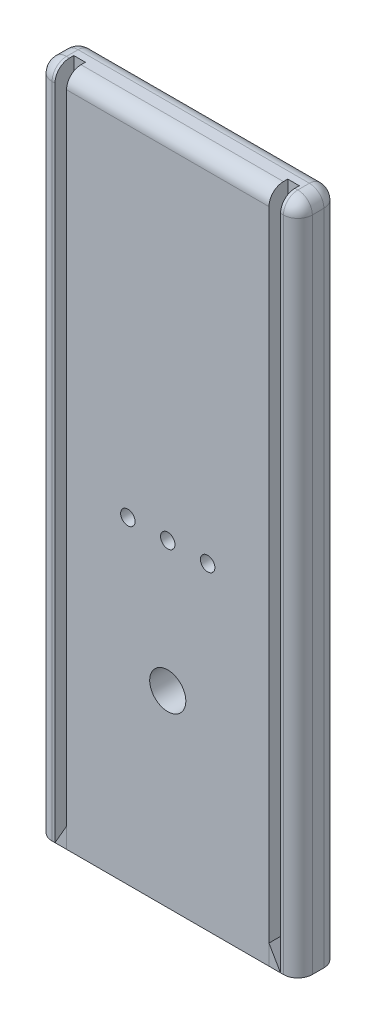
ISO-10303-21;
HEADER;
FILE_DESCRIPTION(('STEP AP214'),'2;1');
FILE_NAME('part.step','',(''),(''),'','','');
FILE_SCHEMA(('AUTOMOTIVE_DESIGN { 1 0 10303 214 1 1 1 1 }'));
ENDSEC;
DATA;
#1=APPLICATION_CONTEXT('core data for automotive mechanical design processes');
#2=APPLICATION_PROTOCOL_DEFINITION('international standard','automotive_design',2000,#1);
#3=PRODUCT_CONTEXT('',#1,'mechanical');
#4=PRODUCT('Part','Part','',(#3));
#5=PRODUCT_RELATED_PRODUCT_CATEGORY('part','',(#4));
#6=PRODUCT_DEFINITION_FORMATION('','',#4);
#7=PRODUCT_DEFINITION_CONTEXT('part definition',#1,'design');
#8=PRODUCT_DEFINITION('design','',#6,#7);
#9=PRODUCT_DEFINITION_SHAPE('','',#8);
#10=(LENGTH_UNIT() NAMED_UNIT(*) SI_UNIT(.MILLI.,.METRE.));
#11=(NAMED_UNIT(*) PLANE_ANGLE_UNIT() SI_UNIT($,.RADIAN.));
#12=(NAMED_UNIT(*) SI_UNIT($,.STERADIAN.) SOLID_ANGLE_UNIT());
#13=UNCERTAINTY_MEASURE_WITH_UNIT(LENGTH_MEASURE(1.E-05),#10,'distance_accuracy_value','');
#14=(GEOMETRIC_REPRESENTATION_CONTEXT(3) GLOBAL_UNCERTAINTY_ASSIGNED_CONTEXT((#13)) GLOBAL_UNIT_ASSIGNED_CONTEXT((#10,
#11,#12)) REPRESENTATION_CONTEXT('',''));
#15=CARTESIAN_POINT('',(0.,0.,0.));
#16=DIRECTION('',(0.,0.,1.));
#17=DIRECTION('',(1.,0.,0.));
#18=AXIS2_PLACEMENT_3D('',#15,#16,#17);
#19=CARTESIAN_POINT('',(44.45,-147.6375,8.89));
#20=DIRECTION('',(0.,1.,0.));
#21=DIRECTION('',(0.,0.,1.));
#22=AXIS2_PLACEMENT_3D('',#19,#20,#21);
#23=PLANE('',#22);
#24=DIRECTION('',(1.,0.,0.));
#25=VECTOR('',#24,1.);
#26=CARTESIAN_POINT('',(44.45,-147.6375,0.635));
#27=LINE('',#26,#25);
#28=CARTESIAN_POINT('',(44.45,-147.6375,0.635));
#29=VERTEX_POINT('',#28);
#30=CARTESIAN_POINT('',(49.53,-147.6375,0.635));
#31=VERTEX_POINT('',#30);
#32=EDGE_CURVE('E91',#29,#31,#27,.T.);
#33=ORIENTED_EDGE('',*,*,#32,.T.);
#34=DIRECTION('',(0.,0.,-1.));
#35=VECTOR('',#34,1.);
#36=CARTESIAN_POINT('',(49.53,-147.6375,8.89));
#37=LINE('',#36,#35);
#38=CARTESIAN_POINT('',(49.53,-147.6375,8.89));
#39=VERTEX_POINT('',#38);
#40=EDGE_CURVE('E12',#39,#31,#37,.T.);
#41=ORIENTED_EDGE('',*,*,#40,.F.);
#42=DIRECTION('',(1.,0.,0.));
#43=VECTOR('',#42,1.);
#44=CARTESIAN_POINT('',(44.45,-147.6375,8.89));
#45=LINE('',#44,#43);
#46=CARTESIAN_POINT('',(44.45,-147.6375,8.89));
#47=VERTEX_POINT('',#46);
#48=EDGE_CURVE('E84',#47,#39,#45,.T.);
#49=ORIENTED_EDGE('',*,*,#48,.F.);
#50=DIRECTION('',(0.,0.,-1.));
#51=VECTOR('',#50,1.);
#52=CARTESIAN_POINT('',(44.45,-147.6375,8.89));
#53=LINE('',#52,#51);
#54=EDGE_CURVE('E92',#47,#29,#53,.T.);
#55=ORIENTED_EDGE('',*,*,#54,.T.);
#56=EDGE_LOOP('',(#33,#41,#49,#55));
#57=FACE_BOUND('',#56,.T.);
#58=ADVANCED_FACE('F44',(#57),#23,.F.);
#59=CARTESIAN_POINT('',(49.53,-147.6375,8.89));
#60=DIRECTION('',(-0.865972767044653,-0.500091158427169,0.));
#61=DIRECTION('',(0.500091158427169,-0.865972767044653,0.));
#62=AXIS2_PLACEMENT_3D('',#59,#60,#61);
#63=PLANE('',#62);
#64=DIRECTION('',(-0.500091158427169,0.865972767044653,0.));
#65=VECTOR('',#64,1.);
#66=CARTESIAN_POINT('',(49.53,-147.6375,0.635));
#67=LINE('',#66,#65);
#68=CARTESIAN_POINT('',(44.45,-138.840820469767,0.635));
#69=VERTEX_POINT('',#68);
#70=EDGE_CURVE('E72',#31,#69,#67,.T.);
#71=ORIENTED_EDGE('',*,*,#70,.T.);
#72=DIRECTION('',(0.,0.,-1.));
#73=VECTOR('',#72,1.);
#74=CARTESIAN_POINT('',(44.45,-138.840820469767,8.89));
#75=LINE('',#74,#73);
#76=CARTESIAN_POINT('',(44.45,-138.840820469767,8.89));
#77=VERTEX_POINT('',#76);
#78=EDGE_CURVE('E52',#77,#69,#75,.T.);
#79=ORIENTED_EDGE('',*,*,#78,.F.);
#80=DIRECTION('',(-0.500091158427169,0.865972767044653,0.));
#81=VECTOR('',#80,1.);
#82=CARTESIAN_POINT('',(49.53,-147.6375,8.89));
#83=LINE('',#82,#81);
#84=EDGE_CURVE('E80',#39,#77,#83,.T.);
#85=ORIENTED_EDGE('',*,*,#84,.F.);
#86=ORIENTED_EDGE('',*,*,#40,.T.);
#87=EDGE_LOOP('',(#71,#79,#85,#86));
#88=FACE_BOUND('',#87,.T.);
#89=ADVANCED_FACE('F81',(#88),#63,.F.);
#90=CARTESIAN_POINT('',(44.45,-138.840820469767,8.89));
#91=DIRECTION('',(1.,0.,0.));
#92=DIRECTION('',(0.,0.,-1.));
#93=AXIS2_PLACEMENT_3D('',#90,#91,#92);
#94=PLANE('',#93);
#95=DIRECTION('',(0.,-1.,0.));
#96=VECTOR('',#95,1.);
#97=CARTESIAN_POINT('',(44.45,-138.840820469767,0.635));
#98=LINE('',#97,#96);
#99=EDGE_CURVE('E77',#69,#29,#98,.T.);
#100=ORIENTED_EDGE('',*,*,#99,.T.);
#101=ORIENTED_EDGE('',*,*,#54,.F.);
#102=DIRECTION('',(0.,-1.,0.));
#103=VECTOR('',#102,1.);
#104=CARTESIAN_POINT('',(44.45,-138.840820469767,8.89));
#105=LINE('',#104,#103);
#106=EDGE_CURVE('E60',#77,#47,#105,.T.);
#107=ORIENTED_EDGE('',*,*,#106,.F.);
#108=ORIENTED_EDGE('',*,*,#78,.T.);
#109=EDGE_LOOP('',(#100,#101,#107,#108));
#110=FACE_BOUND('',#109,.T.);
#111=ADVANCED_FACE('F99',(#110),#94,.F.);
#112=CARTESIAN_POINT('',(0.,0.,8.89));
#113=DIRECTION('',(0.,0.,-1.));
#114=DIRECTION('',(-1.,0.,0.));
#115=AXIS2_PLACEMENT_3D('',#112,#113,#114);
#116=PLANE('',#115);
#117=ORIENTED_EDGE('',*,*,#48,.T.);
#118=ORIENTED_EDGE('',*,*,#84,.T.);
#119=ORIENTED_EDGE('',*,*,#106,.T.);
#120=EDGE_LOOP('',(#117,#118,#119));
#121=FACE_BOUND('',#120,.T.);
#122=ADVANCED_FACE('F87',(#121),#116,.F.);
#123=CARTESIAN_POINT('',(0.,0.,0.635));
#124=DIRECTION('',(0.,0.,-1.));
#125=DIRECTION('',(-1.,0.,0.));
#126=AXIS2_PLACEMENT_3D('',#123,#124,#125);
#127=PLANE('',#126);
#128=ORIENTED_EDGE('',*,*,#32,.F.);
#129=ORIENTED_EDGE('',*,*,#99,.F.);
#130=ORIENTED_EDGE('',*,*,#70,.F.);
#131=EDGE_LOOP('',(#128,#129,#130));
#132=FACE_BOUND('',#131,.T.);
#133=ADVANCED_FACE('F100',(#132),#127,.T.);
#134=CLOSED_SHELL('',(#58,#89,#111,#122,#133));
#135=MANIFOLD_SOLID_BREP('B2',#134);
#136=CARTESIAN_POINT('',(-44.45,-147.6375,8.89));
#137=DIRECTION('',(0.,1.,0.));
#138=DIRECTION('',(0.,0.,1.));
#139=AXIS2_PLACEMENT_3D('',#136,#137,#138);
#140=PLANE('',#139);
#141=DIRECTION('',(1.,0.,0.));
#142=VECTOR('',#141,1.);
#143=CARTESIAN_POINT('',(-44.45,-147.6375,0.635));
#144=LINE('',#143,#142);
#145=CARTESIAN_POINT('',(-49.53,-147.6375,0.635));
#146=VERTEX_POINT('',#145);
#147=CARTESIAN_POINT('',(-44.45,-147.6375,0.635));
#148=VERTEX_POINT('',#147);
#149=EDGE_CURVE('E198',#146,#148,#144,.T.);
#150=ORIENTED_EDGE('',*,*,#149,.T.);
#151=DIRECTION('',(0.,0.,-1.));
#152=VECTOR('',#151,1.);
#153=CARTESIAN_POINT('',(-44.45,-147.6375,8.89));
#154=LINE('',#153,#152);
#155=CARTESIAN_POINT('',(-44.45,-147.6375,8.89));
#156=VERTEX_POINT('',#155);
#157=EDGE_CURVE('E42',#156,#148,#154,.T.);
#158=ORIENTED_EDGE('',*,*,#157,.F.);
#159=DIRECTION('',(1.,0.,0.));
#160=VECTOR('',#159,1.);
#161=CARTESIAN_POINT('',(-44.45,-147.6375,8.89));
#162=LINE('',#161,#160);
#163=CARTESIAN_POINT('',(-49.53,-147.6375,8.89));
#164=VERTEX_POINT('',#163);
#165=EDGE_CURVE('E191',#164,#156,#162,.T.);
#166=ORIENTED_EDGE('',*,*,#165,.F.);
#167=DIRECTION('',(0.,0.,-1.));
#168=VECTOR('',#167,1.);
#169=CARTESIAN_POINT('',(-49.53,-147.6375,8.89));
#170=LINE('',#169,#168);
#171=EDGE_CURVE('E199',#164,#146,#170,.T.);
#172=ORIENTED_EDGE('',*,*,#171,.T.);
#173=EDGE_LOOP('',(#150,#158,#166,#172));
#174=FACE_BOUND('',#173,.T.);
#175=ADVANCED_FACE('F151',(#174),#140,.F.);
#176=CARTESIAN_POINT('',(-44.45,-138.840820469767,8.89));
#177=DIRECTION('',(-1.,0.,0.));
#178=DIRECTION('',(0.,0.,1.));
#179=AXIS2_PLACEMENT_3D('',#176,#177,#178);
#180=PLANE('',#179);
#181=DIRECTION('',(0.,1.,0.));
#182=VECTOR('',#181,1.);
#183=CARTESIAN_POINT('',(-44.45,-138.840820469767,0.635));
#184=LINE('',#183,#182);
#185=CARTESIAN_POINT('',(-44.45,-138.840820469767,0.635));
#186=VERTEX_POINT('',#185);
#187=EDGE_CURVE('E179',#148,#186,#184,.T.);
#188=ORIENTED_EDGE('',*,*,#187,.T.);
#189=DIRECTION('',(0.,0.,-1.));
#190=VECTOR('',#189,1.);
#191=CARTESIAN_POINT('',(-44.45,-138.840820469767,8.89));
#192=LINE('',#191,#190);
#193=CARTESIAN_POINT('',(-44.45,-138.840820469767,8.89));
#194=VERTEX_POINT('',#193);
#195=EDGE_CURVE('E159',#194,#186,#192,.T.);
#196=ORIENTED_EDGE('',*,*,#195,.F.);
#197=DIRECTION('',(0.,1.,0.));
#198=VECTOR('',#197,1.);
#199=CARTESIAN_POINT('',(-44.45,-138.840820469767,8.89));
#200=LINE('',#199,#198);
#201=EDGE_CURVE('E187',#156,#194,#200,.T.);
#202=ORIENTED_EDGE('',*,*,#201,.F.);
#203=ORIENTED_EDGE('',*,*,#157,.T.);
#204=EDGE_LOOP('',(#188,#196,#202,#203));
#205=FACE_BOUND('',#204,.T.);
#206=ADVANCED_FACE('F188',(#205),#180,.F.);
#207=CARTESIAN_POINT('',(-49.53,-147.6375,8.89));
#208=DIRECTION('',(0.865972767044653,-0.500091158427169,0.));
#209=DIRECTION('',(0.500091158427169,0.865972767044653,0.));
#210=AXIS2_PLACEMENT_3D('',#207,#208,#209);
#211=PLANE('',#210);
#212=DIRECTION('',(-0.500091158427169,-0.865972767044653,0.));
#213=VECTOR('',#212,1.);
#214=CARTESIAN_POINT('',(-49.53,-147.6375,0.635));
#215=LINE('',#214,#213);
#216=EDGE_CURVE('E184',#186,#146,#215,.T.);
#217=ORIENTED_EDGE('',*,*,#216,.T.);
#218=ORIENTED_EDGE('',*,*,#171,.F.);
#219=DIRECTION('',(-0.500091158427169,-0.865972767044653,0.));
#220=VECTOR('',#219,1.);
#221=CARTESIAN_POINT('',(-49.53,-147.6375,8.89));
#222=LINE('',#221,#220);
#223=EDGE_CURVE('E167',#194,#164,#222,.T.);
#224=ORIENTED_EDGE('',*,*,#223,.F.);
#225=ORIENTED_EDGE('',*,*,#195,.T.);
#226=EDGE_LOOP('',(#217,#218,#224,#225));
#227=FACE_BOUND('',#226,.T.);
#228=ADVANCED_FACE('F206',(#227),#211,.F.);
#229=CARTESIAN_POINT('',(0.,0.,8.89));
#230=DIRECTION('',(0.,0.,1.));
#231=DIRECTION('',(1.,0.,0.));
#232=AXIS2_PLACEMENT_3D('',#229,#230,#231);
#233=PLANE('',#232);
#234=ORIENTED_EDGE('',*,*,#165,.T.);
#235=ORIENTED_EDGE('',*,*,#201,.T.);
#236=ORIENTED_EDGE('',*,*,#223,.T.);
#237=EDGE_LOOP('',(#234,#235,#236));
#238=FACE_BOUND('',#237,.T.);
#239=ADVANCED_FACE('F194',(#238),#233,.T.);
#240=CARTESIAN_POINT('',(0.,0.,0.635));
#241=DIRECTION('',(0.,0.,1.));
#242=DIRECTION('',(1.,0.,0.));
#243=AXIS2_PLACEMENT_3D('',#240,#241,#242);
#244=PLANE('',#243);
#245=ORIENTED_EDGE('',*,*,#149,.F.);
#246=ORIENTED_EDGE('',*,*,#216,.F.);
#247=ORIENTED_EDGE('',*,*,#187,.F.);
#248=EDGE_LOOP('',(#245,#246,#247));
#249=FACE_BOUND('',#248,.T.);
#250=ADVANCED_FACE('F207',(#249),#244,.F.);
#251=CLOSED_SHELL('',(#175,#206,#228,#239,#250));
#252=MANIFOLD_SOLID_BREP('B6',#251);
#253=CARTESIAN_POINT('',(-57.15,147.6375,8.89));
#254=DIRECTION('',(0.,-1.,0.));
#255=DIRECTION('',(0.,0.,-1.));
#256=AXIS2_PLACEMENT_3D('',#253,#254,#255);
#257=PLANE('',#256);
#258=DIRECTION('',(0.,0.,-1.));
#259=VECTOR('',#258,1.);
#260=CARTESIAN_POINT('',(-44.45,147.6375,8.89));
#261=LINE('',#260,#259);
#262=CARTESIAN_POINT('',(-44.45,147.6375,2.54));
#263=VERTEX_POINT('',#262);
#264=CARTESIAN_POINT('',(-44.45,147.6375,0.635));
#265=VERTEX_POINT('',#264);
#266=EDGE_CURVE('E444',#263,#265,#261,.T.);
#267=ORIENTED_EDGE('',*,*,#266,.F.);
#268=DIRECTION('',(-1.,0.,0.));
#269=VECTOR('',#268,1.);
#270=CARTESIAN_POINT('',(-57.15,147.6375,2.54));
#271=LINE('',#270,#269);
#272=CARTESIAN_POINT('',(44.45,147.6375,2.54));
#273=VERTEX_POINT('',#272);
#274=EDGE_CURVE('E518',#263,#273,#271,.F.);
#275=ORIENTED_EDGE('',*,*,#274,.T.);
#276=DIRECTION('',(0.,0.,-1.));
#277=VECTOR('',#276,1.);
#278=CARTESIAN_POINT('',(44.45,147.6375,8.89));
#279=LINE('',#278,#277);
#280=CARTESIAN_POINT('',(44.45,147.6375,0.635));
#281=VERTEX_POINT('',#280);
#282=EDGE_CURVE('E413',#273,#281,#279,.T.);
#283=ORIENTED_EDGE('',*,*,#282,.T.);
#284=DIRECTION('',(1.,0.,0.));
#285=VECTOR('',#284,1.);
#286=CARTESIAN_POINT('',(49.53,147.6375,0.635));
#287=LINE('',#286,#285);
#288=CARTESIAN_POINT('',(49.53,147.6375,0.635));
#289=VERTEX_POINT('',#288);
#290=EDGE_CURVE('E415',#281,#289,#287,.T.);
#291=ORIENTED_EDGE('',*,*,#290,.T.);
#292=DIRECTION('',(0.,0.,1.));
#293=VECTOR('',#292,1.);
#294=CARTESIAN_POINT('',(49.53,147.6375,8.89));
#295=LINE('',#294,#293);
#296=CARTESIAN_POINT('',(49.53,147.6375,2.54));
#297=VERTEX_POINT('',#296);
#298=EDGE_CURVE('E405',#289,#297,#295,.T.);
#299=ORIENTED_EDGE('',*,*,#298,.T.);
#300=DIRECTION('',(-1.,0.,0.));
#301=VECTOR('',#300,1.);
#302=CARTESIAN_POINT('',(-57.15,147.6375,2.54));
#303=LINE('',#302,#301);
#304=CARTESIAN_POINT('',(50.8,147.6375,2.54));
#305=VERTEX_POINT('',#304);
#306=EDGE_CURVE('E510',#297,#305,#303,.F.);
#307=ORIENTED_EDGE('',*,*,#306,.T.);
#308=DIRECTION('',(0.,0.,-1.));
#309=VECTOR('',#308,1.);
#310=CARTESIAN_POINT('',(50.8,147.6375,8.89));
#311=LINE('',#310,#309);
#312=CARTESIAN_POINT('',(50.8,147.6375,-2.54));
#313=VERTEX_POINT('',#312);
#314=EDGE_CURVE('E508',#305,#313,#311,.T.);
#315=ORIENTED_EDGE('',*,*,#314,.T.);
#316=DIRECTION('',(-1.,0.,0.));
#317=VECTOR('',#316,1.);
#318=CARTESIAN_POINT('',(-57.15,147.6375,-2.54));
#319=LINE('',#318,#317);
#320=CARTESIAN_POINT('',(-50.8,147.6375,-2.54));
#321=VERTEX_POINT('',#320);
#322=EDGE_CURVE('E512',#313,#321,#319,.T.);
#323=ORIENTED_EDGE('',*,*,#322,.T.);
#324=DIRECTION('',(0.,0.,-1.));
#325=VECTOR('',#324,1.);
#326=CARTESIAN_POINT('',(-50.8,147.6375,8.89));
#327=LINE('',#326,#325);
#328=CARTESIAN_POINT('',(-50.8,147.6375,2.54));
#329=VERTEX_POINT('',#328);
#330=EDGE_CURVE('E514',#321,#329,#327,.F.);
#331=ORIENTED_EDGE('',*,*,#330,.T.);
#332=DIRECTION('',(-1.,0.,0.));
#333=VECTOR('',#332,1.);
#334=CARTESIAN_POINT('',(-57.15,147.6375,2.54));
#335=LINE('',#334,#333);
#336=CARTESIAN_POINT('',(-49.53,147.6375,2.54));
#337=VERTEX_POINT('',#336);
#338=EDGE_CURVE('E516',#329,#337,#335,.F.);
#339=ORIENTED_EDGE('',*,*,#338,.T.);
#340=DIRECTION('',(0.,0.,1.));
#341=VECTOR('',#340,1.);
#342=CARTESIAN_POINT('',(-49.53,147.6375,8.89));
#343=LINE('',#342,#341);
#344=CARTESIAN_POINT('',(-49.53,147.6375,0.635));
#345=VERTEX_POINT('',#344);
#346=EDGE_CURVE('E426',#345,#337,#343,.T.);
#347=ORIENTED_EDGE('',*,*,#346,.F.);
#348=DIRECTION('',(-1.,0.,0.));
#349=VECTOR('',#348,1.);
#350=CARTESIAN_POINT('',(-49.53,147.6375,0.635));
#351=LINE('',#350,#349);
#352=EDGE_CURVE('E435',#265,#345,#351,.T.);
#353=ORIENTED_EDGE('',*,*,#352,.F.);
#354=EDGE_LOOP('',(#267,#275,#283,#291,#299,#307,#315,#323,#331,#339,#347,#353));
#355=FACE_BOUND('',#354,.T.);
#356=ADVANCED_FACE('F249',(#355),#257,.F.);
#357=CARTESIAN_POINT('',(-57.15,-147.6375,8.89));
#358=DIRECTION('',(0.,1.,0.));
#359=DIRECTION('',(0.,0.,1.));
#360=AXIS2_PLACEMENT_3D('',#357,#358,#359);
#361=PLANE('',#360);
#362=DIRECTION('',(1.,0.,0.));
#363=VECTOR('',#362,1.);
#364=CARTESIAN_POINT('',(-57.15,-147.6375,-8.89));
#365=LINE('',#364,#363);
#366=CARTESIAN_POINT('',(-50.8,-147.6375,-8.89));
#367=VERTEX_POINT('',#366);
#368=CARTESIAN_POINT('',(50.8,-147.6375,-8.89));
#369=VERTEX_POINT('',#368);
#370=EDGE_CURVE('E474',#367,#369,#365,.T.);
#371=ORIENTED_EDGE('',*,*,#370,.T.);
#372=CARTESIAN_POINT('',(50.8,-147.6375,-2.54));
#373=DIRECTION('',(0.,1.,0.));
#374=DIRECTION('',(0.,0.,1.));
#375=AXIS2_PLACEMENT_3D('',#372,#373,#374);
#376=CIRCLE('',#375,6.35);
#377=CARTESIAN_POINT('',(57.15,-147.6375,-2.54));
#378=VERTEX_POINT('',#377);
#379=EDGE_CURVE('E506',#369,#378,#376,.F.);
#380=ORIENTED_EDGE('',*,*,#379,.T.);
#381=DIRECTION('',(0.,0.,-1.));
#382=VECTOR('',#381,1.);
#383=CARTESIAN_POINT('',(57.15,-147.6375,8.89));
#384=LINE('',#383,#382);
#385=CARTESIAN_POINT('',(57.15,-147.6375,2.54));
#386=VERTEX_POINT('',#385);
#387=EDGE_CURVE('E479',#386,#378,#384,.T.);
#388=ORIENTED_EDGE('',*,*,#387,.F.);
#389=CARTESIAN_POINT('',(50.8,-147.6375,2.54));
#390=DIRECTION('',(0.,1.,0.));
#391=DIRECTION('',(0.,0.,1.));
#392=AXIS2_PLACEMENT_3D('',#389,#390,#391);
#393=CIRCLE('',#392,6.35);
#394=CARTESIAN_POINT('',(50.8,-147.6375,8.89));
#395=VERTEX_POINT('',#394);
#396=EDGE_CURVE('E504',#386,#395,#393,.F.);
#397=ORIENTED_EDGE('',*,*,#396,.T.);
#398=DIRECTION('',(1.,0.,0.));
#399=VECTOR('',#398,1.);
#400=CARTESIAN_POINT('',(-57.15,-147.6375,8.89));
#401=LINE('',#400,#399);
#402=CARTESIAN_POINT('',(49.53,-147.6375,8.89));
#403=VERTEX_POINT('',#402);
#404=EDGE_CURVE('E412',#403,#395,#401,.T.);
#405=ORIENTED_EDGE('',*,*,#404,.F.);
#406=DIRECTION('',(0.,0.,1.));
#407=VECTOR('',#406,1.);
#408=CARTESIAN_POINT('',(49.53,-147.6375,8.89));
#409=LINE('',#408,#407);
#410=CARTESIAN_POINT('',(49.53,-147.6375,0.635));
#411=VERTEX_POINT('',#410);
#412=EDGE_CURVE('E398',#411,#403,#409,.T.);
#413=ORIENTED_EDGE('',*,*,#412,.F.);
#414=DIRECTION('',(1.,0.,0.));
#415=VECTOR('',#414,1.);
#416=CARTESIAN_POINT('',(49.53,-147.6375,0.635));
#417=LINE('',#416,#415);
#418=CARTESIAN_POINT('',(44.45,-147.6375,0.635));
#419=VERTEX_POINT('',#418);
#420=EDGE_CURVE('E386',#419,#411,#417,.T.);
#421=ORIENTED_EDGE('',*,*,#420,.F.);
#422=DIRECTION('',(0.,0.,-1.));
#423=VECTOR('',#422,1.);
#424=CARTESIAN_POINT('',(44.45,-147.6375,8.89));
#425=LINE('',#424,#423);
#426=CARTESIAN_POINT('',(44.45,-147.6375,8.89));
#427=VERTEX_POINT('',#426);
#428=EDGE_CURVE('E397',#427,#419,#425,.T.);
#429=ORIENTED_EDGE('',*,*,#428,.F.);
#430=CARTESIAN_POINT('',(-44.45,-147.6375,8.89));
#431=VERTEX_POINT('',#430);
#432=EDGE_CURVE('E480',#431,#427,#401,.T.);
#433=ORIENTED_EDGE('',*,*,#432,.F.);
#434=DIRECTION('',(0.,0.,-1.));
#435=VECTOR('',#434,1.);
#436=CARTESIAN_POINT('',(-44.45,-147.6375,8.89));
#437=LINE('',#436,#435);
#438=CARTESIAN_POINT('',(-44.45,-147.6375,0.635));
#439=VERTEX_POINT('',#438);
#440=EDGE_CURVE('E434',#431,#439,#437,.T.);
#441=ORIENTED_EDGE('',*,*,#440,.T.);
#442=DIRECTION('',(-1.,0.,0.));
#443=VECTOR('',#442,1.);
#444=CARTESIAN_POINT('',(-49.53,-147.6375,0.635));
#445=LINE('',#444,#443);
#446=CARTESIAN_POINT('',(-49.53,-147.6375,0.635));
#447=VERTEX_POINT('',#446);
#448=EDGE_CURVE('E438',#439,#447,#445,.T.);
#449=ORIENTED_EDGE('',*,*,#448,.T.);
#450=DIRECTION('',(0.,0.,1.));
#451=VECTOR('',#450,1.);
#452=CARTESIAN_POINT('',(-49.53,-147.6375,8.89));
#453=LINE('',#452,#451);
#454=CARTESIAN_POINT('',(-49.53,-147.6375,8.89));
#455=VERTEX_POINT('',#454);
#456=EDGE_CURVE('E431',#447,#455,#453,.T.);
#457=ORIENTED_EDGE('',*,*,#456,.T.);
#458=CARTESIAN_POINT('',(-50.8,-147.6375,8.89));
#459=VERTEX_POINT('',#458);
#460=EDGE_CURVE('E477',#459,#455,#401,.T.);
#461=ORIENTED_EDGE('',*,*,#460,.F.);
#462=CARTESIAN_POINT('',(-50.8,-147.6375,2.54));
#463=DIRECTION('',(0.,1.,0.));
#464=DIRECTION('',(0.,0.,1.));
#465=AXIS2_PLACEMENT_3D('',#462,#463,#464);
#466=CIRCLE('',#465,6.35);
#467=CARTESIAN_POINT('',(-57.15,-147.6375,2.54));
#468=VERTEX_POINT('',#467);
#469=EDGE_CURVE('E500',#459,#468,#466,.F.);
#470=ORIENTED_EDGE('',*,*,#469,.T.);
#471=DIRECTION('',(0.,0.,-1.));
#472=VECTOR('',#471,1.);
#473=CARTESIAN_POINT('',(-57.15,-147.6375,8.89));
#474=LINE('',#473,#472);
#475=CARTESIAN_POINT('',(-57.15,-147.6375,-2.54));
#476=VERTEX_POINT('',#475);
#477=EDGE_CURVE('E484',#468,#476,#474,.T.);
#478=ORIENTED_EDGE('',*,*,#477,.T.);
#479=CARTESIAN_POINT('',(-50.8,-147.6375,-2.54));
#480=DIRECTION('',(0.,1.,0.));
#481=DIRECTION('',(0.,0.,1.));
#482=AXIS2_PLACEMENT_3D('',#479,#480,#481);
#483=CIRCLE('',#482,6.35);
#484=EDGE_CURVE('E502',#476,#367,#483,.F.);
#485=ORIENTED_EDGE('',*,*,#484,.T.);
#486=EDGE_LOOP('',(#371,#380,#388,#397,#405,#413,#421,#429,#433,#441,#449,#457,#461,#470,#478,#485));
#487=FACE_BOUND('',#486,.T.);
#488=ADVANCED_FACE('F410',(#487),#361,.F.);
#489=CARTESIAN_POINT('',(0.,0.,8.89));
#490=DIRECTION('',(0.,0.,-1.));
#491=DIRECTION('',(-1.,0.,0.));
#492=AXIS2_PLACEMENT_3D('',#489,#490,#491);
#493=PLANE('',#492);
#494=ORIENTED_EDGE('',*,*,#404,.T.);
#495=DIRECTION('',(0.,1.,0.));
#496=VECTOR('',#495,1.);
#497=CARTESIAN_POINT('',(50.8,0.,8.89));
#498=LINE('',#497,#496);
#499=CARTESIAN_POINT('',(50.8,141.2875,8.89));
#500=VERTEX_POINT('',#499);
#501=EDGE_CURVE('E522',#395,#500,#498,.T.);
#502=ORIENTED_EDGE('',*,*,#501,.T.);
#503=DIRECTION('',(-1.,0.,0.));
#504=VECTOR('',#503,1.);
#505=CARTESIAN_POINT('',(0.,141.2875,8.89));
#506=LINE('',#505,#504);
#507=CARTESIAN_POINT('',(49.53,141.2875,8.89));
#508=VERTEX_POINT('',#507);
#509=EDGE_CURVE('E520',#500,#508,#506,.T.);
#510=ORIENTED_EDGE('',*,*,#509,.T.);
#511=DIRECTION('',(0.,1.,0.));
#512=VECTOR('',#511,1.);
#513=CARTESIAN_POINT('',(49.53,-147.6375,8.89));
#514=LINE('',#513,#512);
#515=EDGE_CURVE('E424',#403,#508,#514,.T.);
#516=ORIENTED_EDGE('',*,*,#515,.F.);
#517=EDGE_LOOP('',(#494,#502,#510,#516));
#518=FACE_BOUND('',#517,.T.);
#519=ADVANCED_FACE('F650',(#518),#493,.F.);
#520=CARTESIAN_POINT('',(0.,-65.0875,8.89));
#521=DIRECTION('',(0.,0.,1.));
#522=DIRECTION('',(1.,0.,0.));
#523=AXIS2_PLACEMENT_3D('',#520,#521,#522);
#524=CIRCLE('',#523,7.9375);
#525=CARTESIAN_POINT('',(7.9375,-65.0875,8.89));
#526=VERTEX_POINT('',#525);
#527=EDGE_CURVE('E418',#526,#526,#524,.T.);
#528=ORIENTED_EDGE('',*,*,#527,.F.);
#529=EDGE_LOOP('',(#528));
#530=FACE_BOUND('',#529,.T.);
#531=CARTESIAN_POINT('',(0.,-7.93750000000001,8.89));
#532=DIRECTION('',(0.,0.,1.));
#533=DIRECTION('',(1.,0.,0.));
#534=AXIS2_PLACEMENT_3D('',#531,#532,#533);
#535=CIRCLE('',#534,3.175);
#536=CARTESIAN_POINT('',(3.175,-7.93750000000001,8.89));
#537=VERTEX_POINT('',#536);
#538=EDGE_CURVE('E468',#537,#537,#535,.T.);
#539=ORIENTED_EDGE('',*,*,#538,.F.);
#540=EDGE_LOOP('',(#539));
#541=FACE_BOUND('',#540,.T.);
#542=CARTESIAN_POINT('',(-17.526,-7.93750000000001,8.89));
#543=DIRECTION('',(0.,0.,1.));
#544=DIRECTION('',(1.,0.,0.));
#545=AXIS2_PLACEMENT_3D('',#542,#543,#544);
#546=CIRCLE('',#545,3.175);
#547=CARTESIAN_POINT('',(-14.351,-7.93750000000001,8.89));
#548=VERTEX_POINT('',#547);
#549=EDGE_CURVE('E462',#548,#548,#546,.T.);
#550=ORIENTED_EDGE('',*,*,#549,.F.);
#551=EDGE_LOOP('',(#550));
#552=FACE_BOUND('',#551,.T.);
#553=CARTESIAN_POINT('',(17.526,-7.93750000000001,8.89));
#554=DIRECTION('',(0.,0.,1.));
#555=DIRECTION('',(1.,0.,0.));
#556=AXIS2_PLACEMENT_3D('',#553,#554,#555);
#557=CIRCLE('',#556,3.175);
#558=CARTESIAN_POINT('',(20.701,-7.93750000000001,8.89));
#559=VERTEX_POINT('',#558);
#560=EDGE_CURVE('E450',#559,#559,#557,.T.);
#561=ORIENTED_EDGE('',*,*,#560,.F.);
#562=EDGE_LOOP('',(#561));
#563=FACE_BOUND('',#562,.T.);
#564=DIRECTION('',(0.,1.,0.));
#565=VECTOR('',#564,1.);
#566=CARTESIAN_POINT('',(44.45,-147.6375,8.89));
#567=LINE('',#566,#565);
#568=CARTESIAN_POINT('',(44.45,141.2875,8.89));
#569=VERTEX_POINT('',#568);
#570=EDGE_CURVE('E427',#427,#569,#567,.T.);
#571=ORIENTED_EDGE('',*,*,#570,.T.);
#572=DIRECTION('',(-1.,0.,0.));
#573=VECTOR('',#572,1.);
#574=CARTESIAN_POINT('',(0.,141.2875,8.89));
#575=LINE('',#574,#573);
#576=CARTESIAN_POINT('',(-44.45,141.2875,8.89));
#577=VERTEX_POINT('',#576);
#578=EDGE_CURVE('E530',#569,#577,#575,.T.);
#579=ORIENTED_EDGE('',*,*,#578,.T.);
#580=DIRECTION('',(0.,1.,0.));
#581=VECTOR('',#580,1.);
#582=CARTESIAN_POINT('',(-44.45,-147.6375,8.89));
#583=LINE('',#582,#581);
#584=EDGE_CURVE('E454',#431,#577,#583,.T.);
#585=ORIENTED_EDGE('',*,*,#584,.F.);
#586=ORIENTED_EDGE('',*,*,#432,.T.);
#587=EDGE_LOOP('',(#571,#579,#585,#586));
#588=FACE_BOUND('',#587,.T.);
#589=ADVANCED_FACE('F660',(#530,#541,#552,#563,#588),#493,.F.);
#590=DIRECTION('',(0.,1.,0.));
#591=VECTOR('',#590,1.);
#592=CARTESIAN_POINT('',(-49.53,-147.6375,8.89));
#593=LINE('',#592,#591);
#594=CARTESIAN_POINT('',(-49.53,141.2875,8.89));
#595=VERTEX_POINT('',#594);
#596=EDGE_CURVE('E441',#455,#595,#593,.T.);
#597=ORIENTED_EDGE('',*,*,#596,.T.);
#598=DIRECTION('',(-1.,0.,0.));
#599=VECTOR('',#598,1.);
#600=CARTESIAN_POINT('',(0.,141.2875,8.89));
#601=LINE('',#600,#599);
#602=CARTESIAN_POINT('',(-50.8,141.2875,8.89));
#603=VERTEX_POINT('',#602);
#604=EDGE_CURVE('E526',#595,#603,#601,.T.);
#605=ORIENTED_EDGE('',*,*,#604,.T.);
#606=DIRECTION('',(0.,-1.,0.));
#607=VECTOR('',#606,1.);
#608=CARTESIAN_POINT('',(-50.8,0.,8.89));
#609=LINE('',#608,#607);
#610=EDGE_CURVE('E524',#603,#459,#609,.T.);
#611=ORIENTED_EDGE('',*,*,#610,.T.);
#612=ORIENTED_EDGE('',*,*,#460,.T.);
#613=EDGE_LOOP('',(#597,#605,#611,#612));
#614=FACE_BOUND('',#613,.T.);
#615=ADVANCED_FACE('F601',(#614),#493,.F.);
#616=CARTESIAN_POINT('',(57.15,-147.6375,8.89));
#617=DIRECTION('',(-1.,0.,0.));
#618=DIRECTION('',(0.,0.,1.));
#619=AXIS2_PLACEMENT_3D('',#616,#617,#618);
#620=PLANE('',#619);
#621=ORIENTED_EDGE('',*,*,#387,.T.);
#622=DIRECTION('',(0.,1.,0.));
#623=VECTOR('',#622,1.);
#624=CARTESIAN_POINT('',(57.15,147.6375,-2.54));
#625=LINE('',#624,#623);
#626=CARTESIAN_POINT('',(57.15,141.2875,-2.54));
#627=VERTEX_POINT('',#626);
#628=EDGE_CURVE('E491',#378,#627,#625,.T.);
#629=ORIENTED_EDGE('',*,*,#628,.T.);
#630=DIRECTION('',(0.,0.,-1.));
#631=VECTOR('',#630,1.);
#632=CARTESIAN_POINT('',(57.15,141.2875,8.89));
#633=LINE('',#632,#631);
#634=CARTESIAN_POINT('',(57.15,141.2875,2.54));
#635=VERTEX_POINT('',#634);
#636=EDGE_CURVE('E487',#627,#635,#633,.F.);
#637=ORIENTED_EDGE('',*,*,#636,.T.);
#638=DIRECTION('',(0.,1.,0.));
#639=VECTOR('',#638,1.);
#640=CARTESIAN_POINT('',(57.15,-147.6375,2.54));
#641=LINE('',#640,#639);
#642=EDGE_CURVE('E489',#635,#386,#641,.F.);
#643=ORIENTED_EDGE('',*,*,#642,.T.);
#644=EDGE_LOOP('',(#621,#629,#637,#643));
#645=FACE_BOUND('',#644,.T.);
#646=ADVANCED_FACE('F634',(#645),#620,.F.);
#647=CARTESIAN_POINT('',(-57.15,-147.6375,8.89));
#648=DIRECTION('',(1.,0.,0.));
#649=DIRECTION('',(0.,0.,-1.));
#650=AXIS2_PLACEMENT_3D('',#647,#648,#649);
#651=PLANE('',#650);
#652=DIRECTION('',(0.,0.,-1.));
#653=VECTOR('',#652,1.);
#654=CARTESIAN_POINT('',(-57.15,141.2875,8.89));
#655=LINE('',#654,#653);
#656=CARTESIAN_POINT('',(-57.15,141.2875,2.54));
#657=VERTEX_POINT('',#656);
#658=CARTESIAN_POINT('',(-57.15,141.2875,-2.54));
#659=VERTEX_POINT('',#658);
#660=EDGE_CURVE('E258',#657,#659,#655,.T.);
#661=ORIENTED_EDGE('',*,*,#660,.T.);
#662=DIRECTION('',(0.,-1.,0.));
#663=VECTOR('',#662,1.);
#664=CARTESIAN_POINT('',(-57.15,-147.6375,-2.54));
#665=LINE('',#664,#663);
#666=EDGE_CURVE('E149',#659,#476,#665,.T.);
#667=ORIENTED_EDGE('',*,*,#666,.T.);
#668=ORIENTED_EDGE('',*,*,#477,.F.);
#669=DIRECTION('',(0.,-1.,0.));
#670=VECTOR('',#669,1.);
#671=CARTESIAN_POINT('',(-57.15,-147.6375,2.54));
#672=LINE('',#671,#670);
#673=EDGE_CURVE('E269',#468,#657,#672,.F.);
#674=ORIENTED_EDGE('',*,*,#673,.T.);
#675=EDGE_LOOP('',(#661,#667,#668,#674));
#676=FACE_BOUND('',#675,.T.);
#677=ADVANCED_FACE('F593',(#676),#651,.F.);
#678=CARTESIAN_POINT('',(0.,0.,-8.89));
#679=DIRECTION('',(0.,0.,-1.));
#680=DIRECTION('',(-1.,0.,0.));
#681=AXIS2_PLACEMENT_3D('',#678,#679,#680);
#682=PLANE('',#681);
#683=CARTESIAN_POINT('',(0.,-65.0875,-8.89));
#684=DIRECTION('',(0.,0.,1.));
#685=DIRECTION('',(1.,0.,0.));
#686=AXIS2_PLACEMENT_3D('',#683,#684,#685);
#687=CIRCLE('',#686,7.9375);
#688=CARTESIAN_POINT('',(7.9375,-65.0875,-8.89));
#689=VERTEX_POINT('',#688);
#690=EDGE_CURVE('E544',#689,#689,#687,.T.);
#691=ORIENTED_EDGE('',*,*,#690,.T.);
#692=EDGE_LOOP('',(#691));
#693=FACE_BOUND('',#692,.T.);
#694=DIRECTION('',(-1.,0.,0.));
#695=VECTOR('',#694,1.);
#696=CARTESIAN_POINT('',(57.15,141.2875,-8.89));
#697=LINE('',#696,#695);
#698=CARTESIAN_POINT('',(-50.8,141.2875,-8.89));
#699=VERTEX_POINT('',#698);
#700=CARTESIAN_POINT('',(50.8,141.2875,-8.89));
#701=VERTEX_POINT('',#700);
#702=EDGE_CURVE('E496',#699,#701,#697,.F.);
#703=ORIENTED_EDGE('',*,*,#702,.T.);
#704=DIRECTION('',(0.,1.,0.));
#705=VECTOR('',#704,1.);
#706=CARTESIAN_POINT('',(50.8,-147.6375,-8.89));
#707=LINE('',#706,#705);
#708=EDGE_CURVE('E498',#701,#369,#707,.F.);
#709=ORIENTED_EDGE('',*,*,#708,.T.);
#710=ORIENTED_EDGE('',*,*,#370,.F.);
#711=DIRECTION('',(0.,-1.,0.));
#712=VECTOR('',#711,1.);
#713=CARTESIAN_POINT('',(-50.8,147.6375,-8.89));
#714=LINE('',#713,#712);
#715=EDGE_CURVE('E494',#367,#699,#714,.F.);
#716=ORIENTED_EDGE('',*,*,#715,.T.);
#717=EDGE_LOOP('',(#703,#709,#710,#716));
#718=FACE_BOUND('',#717,.T.);
#719=ADVANCED_FACE('F630',(#693,#718),#682,.T.);
#720=CARTESIAN_POINT('',(0.,-7.93750000000001,-3.81));
#721=DIRECTION('',(0.,0.,1.));
#722=DIRECTION('',(1.,0.,0.));
#723=AXIS2_PLACEMENT_3D('',#720,#721,#722);
#724=CYLINDRICAL_SURFACE('',#723,3.175);
#725=CARTESIAN_POINT('',(0.,-7.93750000000001,-3.81));
#726=DIRECTION('',(0.,0.,1.));
#727=DIRECTION('',(1.,0.,0.));
#728=AXIS2_PLACEMENT_3D('',#725,#726,#727);
#729=CIRCLE('',#728,3.175);
#730=CARTESIAN_POINT('',(3.175,-7.93750000000001,-3.81));
#731=VERTEX_POINT('',#730);
#732=EDGE_CURVE('E471',#731,#731,#729,.T.);
#733=ORIENTED_EDGE('',*,*,#732,.F.);
#734=EDGE_LOOP('',(#733));
#735=FACE_BOUND('',#734,.T.);
#736=ORIENTED_EDGE('',*,*,#538,.T.);
#737=EDGE_LOOP('',(#736));
#738=FACE_BOUND('',#737,.T.);
#739=ADVANCED_FACE('F839',(#735,#738),#724,.F.);
#740=CARTESIAN_POINT('',(0.,-7.93750000000001,-3.81));
#741=DIRECTION('',(0.,0.,1.));
#742=DIRECTION('',(1.,0.,0.));
#743=AXIS2_PLACEMENT_3D('',#740,#741,#742);
#744=PLANE('',#743);
#745=ORIENTED_EDGE('',*,*,#732,.T.);
#746=EDGE_LOOP('',(#745));
#747=FACE_BOUND('',#746,.T.);
#748=ADVANCED_FACE('F884',(#747),#744,.T.);
#749=CARTESIAN_POINT('',(-17.526,-7.93750000000001,-3.81));
#750=DIRECTION('',(0.,0.,1.));
#751=DIRECTION('',(1.,0.,0.));
#752=AXIS2_PLACEMENT_3D('',#749,#750,#751);
#753=CYLINDRICAL_SURFACE('',#752,3.175);
#754=CARTESIAN_POINT('',(-17.526,-7.93750000000001,-3.81));
#755=DIRECTION('',(0.,0.,1.));
#756=DIRECTION('',(1.,0.,0.));
#757=AXIS2_PLACEMENT_3D('',#754,#755,#756);
#758=CIRCLE('',#757,3.175);
#759=CARTESIAN_POINT('',(-14.351,-7.93750000000001,-3.81));
#760=VERTEX_POINT('',#759);
#761=EDGE_CURVE('E465',#760,#760,#758,.T.);
#762=ORIENTED_EDGE('',*,*,#761,.F.);
#763=EDGE_LOOP('',(#762));
#764=FACE_BOUND('',#763,.T.);
#765=ORIENTED_EDGE('',*,*,#549,.T.);
#766=EDGE_LOOP('',(#765));
#767=FACE_BOUND('',#766,.T.);
#768=ADVANCED_FACE('F877',(#764,#767),#753,.F.);
#769=CARTESIAN_POINT('',(-17.526,-7.93750000000001,-3.81));
#770=DIRECTION('',(0.,0.,1.));
#771=DIRECTION('',(1.,0.,0.));
#772=AXIS2_PLACEMENT_3D('',#769,#770,#771);
#773=PLANE('',#772);
#774=ORIENTED_EDGE('',*,*,#761,.T.);
#775=EDGE_LOOP('',(#774));
#776=FACE_BOUND('',#775,.T.);
#777=ADVANCED_FACE('F868',(#776),#773,.T.);
#778=CARTESIAN_POINT('',(17.526,-7.93750000000001,-3.81));
#779=DIRECTION('',(0.,0.,1.));
#780=DIRECTION('',(1.,0.,0.));
#781=AXIS2_PLACEMENT_3D('',#778,#779,#780);
#782=CYLINDRICAL_SURFACE('',#781,3.175);
#783=CARTESIAN_POINT('',(17.526,-7.93750000000001,-3.81));
#784=DIRECTION('',(0.,0.,1.));
#785=DIRECTION('',(1.,0.,0.));
#786=AXIS2_PLACEMENT_3D('',#783,#784,#785);
#787=CIRCLE('',#786,3.175);
#788=CARTESIAN_POINT('',(20.701,-7.93750000000001,-3.81));
#789=VERTEX_POINT('',#788);
#790=EDGE_CURVE('E459',#789,#789,#787,.T.);
#791=ORIENTED_EDGE('',*,*,#790,.F.);
#792=EDGE_LOOP('',(#791));
#793=FACE_BOUND('',#792,.T.);
#794=ORIENTED_EDGE('',*,*,#560,.T.);
#795=EDGE_LOOP('',(#794));
#796=FACE_BOUND('',#795,.T.);
#797=ADVANCED_FACE('F866',(#793,#796),#782,.F.);
#798=CARTESIAN_POINT('',(17.526,-7.93750000000001,-3.81));
#799=DIRECTION('',(0.,0.,1.));
#800=DIRECTION('',(1.,0.,0.));
#801=AXIS2_PLACEMENT_3D('',#798,#799,#800);
#802=PLANE('',#801);
#803=ORIENTED_EDGE('',*,*,#790,.T.);
#804=EDGE_LOOP('',(#803));
#805=FACE_BOUND('',#804,.T.);
#806=ADVANCED_FACE('F674',(#805),#802,.T.);
#807=CARTESIAN_POINT('',(-49.53,-147.6375,8.89));
#808=DIRECTION('',(-1.,0.,0.));
#809=DIRECTION('',(0.,0.,1.));
#810=AXIS2_PLACEMENT_3D('',#807,#808,#809);
#811=PLANE('',#810);
#812=ORIENTED_EDGE('',*,*,#346,.T.);
#813=CARTESIAN_POINT('',(-49.53,141.2875,2.54));
#814=DIRECTION('',(-1.,0.,0.));
#815=DIRECTION('',(0.,0.,1.));
#816=AXIS2_PLACEMENT_3D('',#813,#814,#815);
#817=CIRCLE('',#816,6.35);
#818=EDGE_CURVE('E528',#337,#595,#817,.F.);
#819=ORIENTED_EDGE('',*,*,#818,.T.);
#820=ORIENTED_EDGE('',*,*,#596,.F.);
#821=ORIENTED_EDGE('',*,*,#456,.F.);
#822=DIRECTION('',(0.,1.,0.));
#823=VECTOR('',#822,1.);
#824=CARTESIAN_POINT('',(-49.53,-147.6375,0.635));
#825=LINE('',#824,#823);
#826=EDGE_CURVE('E448',#447,#345,#825,.T.);
#827=ORIENTED_EDGE('',*,*,#826,.T.);
#828=EDGE_LOOP('',(#812,#819,#820,#821,#827));
#829=FACE_BOUND('',#828,.T.);
#830=ADVANCED_FACE('F606',(#829),#811,.F.);
#831=CARTESIAN_POINT('',(-49.53,-147.6375,0.635));
#832=DIRECTION('',(0.,0.,-1.));
#833=DIRECTION('',(-1.,0.,0.));
#834=AXIS2_PLACEMENT_3D('',#831,#832,#833);
#835=PLANE('',#834);
#836=ORIENTED_EDGE('',*,*,#352,.T.);
#837=ORIENTED_EDGE('',*,*,#826,.F.);
#838=ORIENTED_EDGE('',*,*,#448,.F.);
#839=DIRECTION('',(0.,1.,0.));
#840=VECTOR('',#839,1.);
#841=CARTESIAN_POINT('',(-44.45,-147.6375,0.635));
#842=LINE('',#841,#840);
#843=EDGE_CURVE('E451',#439,#265,#842,.T.);
#844=ORIENTED_EDGE('',*,*,#843,.T.);
#845=EDGE_LOOP('',(#836,#837,#838,#844));
#846=FACE_BOUND('',#845,.T.);
#847=ADVANCED_FACE('F666',(#846),#835,.F.);
#848=CARTESIAN_POINT('',(-44.45,-147.6375,8.89));
#849=DIRECTION('',(1.,0.,0.));
#850=DIRECTION('',(0.,0.,-1.));
#851=AXIS2_PLACEMENT_3D('',#848,#849,#850);
#852=PLANE('',#851);
#853=ORIENTED_EDGE('',*,*,#584,.T.);
#854=CARTESIAN_POINT('',(-44.45,141.2875,2.54));
#855=DIRECTION('',(1.,0.,0.));
#856=DIRECTION('',(0.,0.,-1.));
#857=AXIS2_PLACEMENT_3D('',#854,#855,#856);
#858=CIRCLE('',#857,6.35);
#859=EDGE_CURVE('E533',#577,#263,#858,.F.);
#860=ORIENTED_EDGE('',*,*,#859,.T.);
#861=ORIENTED_EDGE('',*,*,#266,.T.);
#862=ORIENTED_EDGE('',*,*,#843,.F.);
#863=ORIENTED_EDGE('',*,*,#440,.F.);
#864=EDGE_LOOP('',(#853,#860,#861,#862,#863));
#865=FACE_BOUND('',#864,.T.);
#866=ADVANCED_FACE('F663',(#865),#852,.F.);
#867=CARTESIAN_POINT('',(49.53,-147.6375,8.89));
#868=DIRECTION('',(-1.,0.,0.));
#869=DIRECTION('',(0.,0.,1.));
#870=AXIS2_PLACEMENT_3D('',#867,#868,#869);
#871=PLANE('',#870);
#872=ORIENTED_EDGE('',*,*,#515,.T.);
#873=CARTESIAN_POINT('',(49.53,141.2875,2.54));
#874=DIRECTION('',(-1.,0.,0.));
#875=DIRECTION('',(0.,0.,1.));
#876=AXIS2_PLACEMENT_3D('',#873,#874,#875);
#877=CIRCLE('',#876,6.35);
#878=EDGE_CURVE('E537',#508,#297,#877,.T.);
#879=ORIENTED_EDGE('',*,*,#878,.T.);
#880=ORIENTED_EDGE('',*,*,#298,.F.);
#881=DIRECTION('',(0.,1.,0.));
#882=VECTOR('',#881,1.);
#883=CARTESIAN_POINT('',(49.53,-147.6375,0.635));
#884=LINE('',#883,#882);
#885=EDGE_CURVE('E390',#411,#289,#884,.T.);
#886=ORIENTED_EDGE('',*,*,#885,.F.);
#887=ORIENTED_EDGE('',*,*,#412,.T.);
#888=EDGE_LOOP('',(#872,#879,#880,#886,#887));
#889=FACE_BOUND('',#888,.T.);
#890=ADVANCED_FACE('F402',(#889),#871,.T.);
#891=CARTESIAN_POINT('',(44.45,-147.6375,8.89));
#892=DIRECTION('',(1.,0.,0.));
#893=DIRECTION('',(0.,0.,-1.));
#894=AXIS2_PLACEMENT_3D('',#891,#892,#893);
#895=PLANE('',#894);
#896=ORIENTED_EDGE('',*,*,#282,.F.);
#897=CARTESIAN_POINT('',(44.45,141.2875,2.54));
#898=DIRECTION('',(1.,0.,0.));
#899=DIRECTION('',(0.,0.,-1.));
#900=AXIS2_PLACEMENT_3D('',#897,#898,#899);
#901=CIRCLE('',#900,6.35);
#902=EDGE_CURVE('E535',#273,#569,#901,.T.);
#903=ORIENTED_EDGE('',*,*,#902,.T.);
#904=ORIENTED_EDGE('',*,*,#570,.F.);
#905=ORIENTED_EDGE('',*,*,#428,.T.);
#906=DIRECTION('',(0.,1.,0.));
#907=VECTOR('',#906,1.);
#908=CARTESIAN_POINT('',(44.45,-147.6375,0.635));
#909=LINE('',#908,#907);
#910=EDGE_CURVE('E393',#419,#281,#909,.T.);
#911=ORIENTED_EDGE('',*,*,#910,.T.);
#912=EDGE_LOOP('',(#896,#903,#904,#905,#911));
#913=FACE_BOUND('',#912,.T.);
#914=ADVANCED_FACE('F655',(#913),#895,.T.);
#915=CARTESIAN_POINT('',(49.53,-147.6375,0.635));
#916=DIRECTION('',(0.,0.,1.));
#917=DIRECTION('',(1.,0.,0.));
#918=AXIS2_PLACEMENT_3D('',#915,#916,#917);
#919=PLANE('',#918);
#920=ORIENTED_EDGE('',*,*,#290,.F.);
#921=ORIENTED_EDGE('',*,*,#910,.F.);
#922=ORIENTED_EDGE('',*,*,#420,.T.);
#923=ORIENTED_EDGE('',*,*,#885,.T.);
#924=EDGE_LOOP('',(#920,#921,#922,#923));
#925=FACE_BOUND('',#924,.T.);
#926=ADVANCED_FACE('F389',(#925),#919,.T.);
#927=CARTESIAN_POINT('',(0.,141.2875,2.54));
#928=DIRECTION('',(-1.,0.,0.));
#929=DIRECTION('',(0.,0.,1.));
#930=AXIS2_PLACEMENT_3D('',#927,#928,#929);
#931=CYLINDRICAL_SURFACE('',#930,6.35);
#932=ORIENTED_EDGE('',*,*,#818,.F.);
#933=ORIENTED_EDGE('',*,*,#338,.F.);
#934=CARTESIAN_POINT('',(-50.8,141.2875,2.54));
#935=DIRECTION('',(-1.,0.,0.));
#936=DIRECTION('',(0.,0.,1.));
#937=AXIS2_PLACEMENT_3D('',#934,#935,#936);
#938=CIRCLE('',#937,6.35);
#939=EDGE_CURVE('E253',#603,#329,#938,.T.);
#940=ORIENTED_EDGE('',*,*,#939,.F.);
#941=ORIENTED_EDGE('',*,*,#604,.F.);
#942=EDGE_LOOP('',(#932,#933,#940,#941));
#943=FACE_BOUND('',#942,.T.);
#944=ADVANCED_FACE('F604',(#943),#931,.T.);
#945=CARTESIAN_POINT('',(-50.8,0.,2.54));
#946=DIRECTION('',(0.,-1.,0.));
#947=DIRECTION('',(0.,0.,-1.));
#948=AXIS2_PLACEMENT_3D('',#945,#946,#947);
#949=CYLINDRICAL_SURFACE('',#948,6.35);
#950=ORIENTED_EDGE('',*,*,#469,.F.);
#951=ORIENTED_EDGE('',*,*,#610,.F.);
#952=CARTESIAN_POINT('',(-50.8,141.2875,2.54));
#953=DIRECTION('',(0.,1.,0.));
#954=DIRECTION('',(0.,0.,1.));
#955=AXIS2_PLACEMENT_3D('',#952,#953,#954);
#956=CIRCLE('',#955,6.35);
#957=EDGE_CURVE('E570',#657,#603,#956,.T.);
#958=ORIENTED_EDGE('',*,*,#957,.F.);
#959=ORIENTED_EDGE('',*,*,#673,.F.);
#960=EDGE_LOOP('',(#950,#951,#958,#959));
#961=FACE_BOUND('',#960,.T.);
#962=ADVANCED_FACE('F599',(#961),#949,.T.);
#963=CARTESIAN_POINT('',(-50.8,141.2875,2.54));
#964=DIRECTION('',(0.,0.,1.));
#965=DIRECTION('',(1.,0.,0.));
#966=AXIS2_PLACEMENT_3D('',#963,#964,#965);
#967=SPHERICAL_SURFACE('',#966,6.35);
#968=ORIENTED_EDGE('',*,*,#957,.T.);
#969=ORIENTED_EDGE('',*,*,#939,.T.);
#970=CARTESIAN_POINT('',(-50.8,141.2875,2.54));
#971=DIRECTION('',(0.,0.,1.));
#972=DIRECTION('',(1.,0.,0.));
#973=AXIS2_PLACEMENT_3D('',#970,#971,#972);
#974=CIRCLE('',#973,6.35);
#975=EDGE_CURVE('E568',#657,#329,#974,.F.);
#976=ORIENTED_EDGE('',*,*,#975,.F.);
#977=EDGE_LOOP('',(#968,#969,#976));
#978=FACE_BOUND('',#977,.T.);
#979=ADVANCED_FACE('F576',(#978),#967,.T.);
#980=CARTESIAN_POINT('',(50.8,0.,2.54));
#981=DIRECTION('',(0.,1.,0.));
#982=DIRECTION('',(0.,0.,1.));
#983=AXIS2_PLACEMENT_3D('',#980,#981,#982);
#984=CYLINDRICAL_SURFACE('',#983,6.35);
#985=ORIENTED_EDGE('',*,*,#396,.F.);
#986=ORIENTED_EDGE('',*,*,#642,.F.);
#987=CARTESIAN_POINT('',(50.8,141.2875,2.54));
#988=DIRECTION('',(0.,1.,0.));
#989=DIRECTION('',(0.,0.,1.));
#990=AXIS2_PLACEMENT_3D('',#987,#988,#989);
#991=CIRCLE('',#990,6.35);
#992=EDGE_CURVE('E565',#500,#635,#991,.T.);
#993=ORIENTED_EDGE('',*,*,#992,.F.);
#994=ORIENTED_EDGE('',*,*,#501,.F.);
#995=EDGE_LOOP('',(#985,#986,#993,#994));
#996=FACE_BOUND('',#995,.T.);
#997=ADVANCED_FACE('F638',(#996),#984,.T.);
#998=CARTESIAN_POINT('',(0.,141.2875,2.54));
#999=DIRECTION('',(-1.,0.,0.));
#1000=DIRECTION('',(0.,0.,1.));
#1001=AXIS2_PLACEMENT_3D('',#998,#999,#1000);
#1002=CYLINDRICAL_SURFACE('',#1001,6.35);
#1003=ORIENTED_EDGE('',*,*,#878,.F.);
#1004=ORIENTED_EDGE('',*,*,#509,.F.);
#1005=CARTESIAN_POINT('',(50.8,141.2875,2.54));
#1006=DIRECTION('',(1.,0.,0.));
#1007=DIRECTION('',(0.,0.,-1.));
#1008=AXIS2_PLACEMENT_3D('',#1005,#1006,#1007);
#1009=CIRCLE('',#1008,6.35);
#1010=EDGE_CURVE('E562',#305,#500,#1009,.T.);
#1011=ORIENTED_EDGE('',*,*,#1010,.F.);
#1012=ORIENTED_EDGE('',*,*,#306,.F.);
#1013=EDGE_LOOP('',(#1003,#1004,#1011,#1012));
#1014=FACE_BOUND('',#1013,.T.);
#1015=ADVANCED_FACE('F648',(#1014),#1002,.T.);
#1016=CARTESIAN_POINT('',(-50.8,141.2875,8.89));
#1017=DIRECTION('',(0.,0.,-1.));
#1018=DIRECTION('',(-1.,0.,0.));
#1019=AXIS2_PLACEMENT_3D('',#1016,#1017,#1018);
#1020=CYLINDRICAL_SURFACE('',#1019,6.35);
#1021=ORIENTED_EDGE('',*,*,#975,.T.);
#1022=ORIENTED_EDGE('',*,*,#330,.F.);
#1023=CARTESIAN_POINT('',(-50.8,141.2875,-2.54));
#1024=DIRECTION('',(0.,0.,-1.));
#1025=DIRECTION('',(-1.,0.,0.));
#1026=AXIS2_PLACEMENT_3D('',#1023,#1024,#1025);
#1027=CIRCLE('',#1026,6.35);
#1028=EDGE_CURVE('E559',#659,#321,#1027,.T.);
#1029=ORIENTED_EDGE('',*,*,#1028,.F.);
#1030=ORIENTED_EDGE('',*,*,#660,.F.);
#1031=EDGE_LOOP('',(#1021,#1022,#1029,#1030));
#1032=FACE_BOUND('',#1031,.T.);
#1033=ADVANCED_FACE('F582',(#1032),#1020,.T.);
#1034=CARTESIAN_POINT('',(-50.8,-147.6375,-2.54));
#1035=DIRECTION('',(0.,1.,0.));
#1036=DIRECTION('',(0.,0.,1.));
#1037=AXIS2_PLACEMENT_3D('',#1034,#1035,#1036);
#1038=CYLINDRICAL_SURFACE('',#1037,6.35);
#1039=ORIENTED_EDGE('',*,*,#484,.F.);
#1040=ORIENTED_EDGE('',*,*,#666,.F.);
#1041=CARTESIAN_POINT('',(-50.8,141.2875,-2.54));
#1042=DIRECTION('',(0.,1.,0.));
#1043=DIRECTION('',(0.,0.,1.));
#1044=AXIS2_PLACEMENT_3D('',#1041,#1042,#1043);
#1045=CIRCLE('',#1044,6.35);
#1046=EDGE_CURVE('E556',#699,#659,#1045,.T.);
#1047=ORIENTED_EDGE('',*,*,#1046,.F.);
#1048=ORIENTED_EDGE('',*,*,#715,.F.);
#1049=EDGE_LOOP('',(#1039,#1040,#1047,#1048));
#1050=FACE_BOUND('',#1049,.T.);
#1051=ADVANCED_FACE('F592',(#1050),#1038,.T.);
#1052=CARTESIAN_POINT('',(50.8,141.2875,2.54));
#1053=DIRECTION('',(0.,0.,1.));
#1054=DIRECTION('',(1.,0.,0.));
#1055=AXIS2_PLACEMENT_3D('',#1052,#1053,#1054);
#1056=SPHERICAL_SURFACE('',#1055,6.35);
#1057=ORIENTED_EDGE('',*,*,#1010,.T.);
#1058=ORIENTED_EDGE('',*,*,#992,.T.);
#1059=CARTESIAN_POINT('',(50.8,141.2875,2.54));
#1060=DIRECTION('',(0.,0.,1.));
#1061=DIRECTION('',(1.,0.,0.));
#1062=AXIS2_PLACEMENT_3D('',#1059,#1060,#1061);
#1063=CIRCLE('',#1062,6.35);
#1064=EDGE_CURVE('E553',#305,#635,#1063,.F.);
#1065=ORIENTED_EDGE('',*,*,#1064,.F.);
#1066=EDGE_LOOP('',(#1057,#1058,#1065));
#1067=FACE_BOUND('',#1066,.T.);
#1068=ADVANCED_FACE('F642',(#1067),#1056,.T.);
#1069=CARTESIAN_POINT('',(-50.8,141.2875,-2.54));
#1070=DIRECTION('',(0.,0.,1.));
#1071=DIRECTION('',(1.,0.,0.));
#1072=AXIS2_PLACEMENT_3D('',#1069,#1070,#1071);
#1073=SPHERICAL_SURFACE('',#1072,6.35);
#1074=ORIENTED_EDGE('',*,*,#1046,.T.);
#1075=ORIENTED_EDGE('',*,*,#1028,.T.);
#1076=CARTESIAN_POINT('',(-50.8,141.2875,-2.54));
#1077=DIRECTION('',(-1.,0.,0.));
#1078=DIRECTION('',(0.,0.,1.));
#1079=AXIS2_PLACEMENT_3D('',#1076,#1077,#1078);
#1080=CIRCLE('',#1079,6.35);
#1081=EDGE_CURVE('E550',#699,#321,#1080,.F.);
#1082=ORIENTED_EDGE('',*,*,#1081,.F.);
#1083=EDGE_LOOP('',(#1074,#1075,#1082));
#1084=FACE_BOUND('',#1083,.T.);
#1085=ADVANCED_FACE('F587',(#1084),#1073,.T.);
#1086=CARTESIAN_POINT('',(50.8,141.2875,8.89));
#1087=DIRECTION('',(0.,0.,-1.));
#1088=DIRECTION('',(-1.,0.,0.));
#1089=AXIS2_PLACEMENT_3D('',#1086,#1087,#1088);
#1090=CYLINDRICAL_SURFACE('',#1089,6.35);
#1091=ORIENTED_EDGE('',*,*,#1064,.T.);
#1092=ORIENTED_EDGE('',*,*,#636,.F.);
#1093=CARTESIAN_POINT('',(50.8,141.2875,-2.54));
#1094=DIRECTION('',(0.,0.,-1.));
#1095=DIRECTION('',(-1.,0.,0.));
#1096=AXIS2_PLACEMENT_3D('',#1093,#1094,#1095);
#1097=CIRCLE('',#1096,6.35);
#1098=EDGE_CURVE('E547',#313,#627,#1097,.T.);
#1099=ORIENTED_EDGE('',*,*,#1098,.F.);
#1100=ORIENTED_EDGE('',*,*,#314,.F.);
#1101=EDGE_LOOP('',(#1091,#1092,#1099,#1100));
#1102=FACE_BOUND('',#1101,.T.);
#1103=ADVANCED_FACE('F621',(#1102),#1090,.T.);
#1104=CARTESIAN_POINT('',(-57.15,141.2875,-2.54));
#1105=DIRECTION('',(1.,0.,0.));
#1106=DIRECTION('',(0.,0.,-1.));
#1107=AXIS2_PLACEMENT_3D('',#1104,#1105,#1106);
#1108=CYLINDRICAL_SURFACE('',#1107,6.35);
#1109=ORIENTED_EDGE('',*,*,#1081,.T.);
#1110=ORIENTED_EDGE('',*,*,#322,.F.);
#1111=CARTESIAN_POINT('',(50.8,141.2875,-2.54));
#1112=DIRECTION('',(1.,0.,0.));
#1113=DIRECTION('',(0.,1.,0.));
#1114=AXIS2_PLACEMENT_3D('',#1111,#1112,#1113);
#1115=CIRCLE('',#1114,6.35);
#1116=EDGE_CURVE('E543',#701,#313,#1115,.T.);
#1117=ORIENTED_EDGE('',*,*,#1116,.F.);
#1118=ORIENTED_EDGE('',*,*,#702,.F.);
#1119=EDGE_LOOP('',(#1109,#1110,#1117,#1118));
#1120=FACE_BOUND('',#1119,.T.);
#1121=ADVANCED_FACE('F617',(#1120),#1108,.T.);
#1122=CARTESIAN_POINT('',(50.8,141.2875,-2.54));
#1123=DIRECTION('',(0.,0.,1.));
#1124=DIRECTION('',(1.,0.,0.));
#1125=AXIS2_PLACEMENT_3D('',#1122,#1123,#1124);
#1126=SPHERICAL_SURFACE('',#1125,6.35);
#1127=ORIENTED_EDGE('',*,*,#1116,.T.);
#1128=ORIENTED_EDGE('',*,*,#1098,.T.);
#1129=CARTESIAN_POINT('',(50.8,141.2875,-2.54));
#1130=DIRECTION('',(0.,1.,0.));
#1131=DIRECTION('',(0.,0.,1.));
#1132=AXIS2_PLACEMENT_3D('',#1129,#1130,#1131);
#1133=CIRCLE('',#1132,6.35);
#1134=EDGE_CURVE('E541',#701,#627,#1133,.F.);
#1135=ORIENTED_EDGE('',*,*,#1134,.F.);
#1136=EDGE_LOOP('',(#1127,#1128,#1135));
#1137=FACE_BOUND('',#1136,.T.);
#1138=ADVANCED_FACE('F624',(#1137),#1126,.T.);
#1139=CARTESIAN_POINT('',(50.8,-147.6375,-2.54));
#1140=DIRECTION('',(0.,-1.,0.));
#1141=DIRECTION('',(0.,0.,-1.));
#1142=AXIS2_PLACEMENT_3D('',#1139,#1140,#1141);
#1143=CYLINDRICAL_SURFACE('',#1142,6.35);
#1144=ORIENTED_EDGE('',*,*,#379,.F.);
#1145=ORIENTED_EDGE('',*,*,#708,.F.);
#1146=ORIENTED_EDGE('',*,*,#1134,.T.);
#1147=ORIENTED_EDGE('',*,*,#628,.F.);
#1148=EDGE_LOOP('',(#1144,#1145,#1146,#1147));
#1149=FACE_BOUND('',#1148,.T.);
#1150=ADVANCED_FACE('F628',(#1149),#1143,.T.);
#1151=CARTESIAN_POINT('',(0.,141.2875,2.54));
#1152=DIRECTION('',(-1.,0.,0.));
#1153=DIRECTION('',(0.,0.,1.));
#1154=AXIS2_PLACEMENT_3D('',#1151,#1152,#1153);
#1155=CYLINDRICAL_SURFACE('',#1154,6.35);
#1156=ORIENTED_EDGE('',*,*,#902,.F.);
#1157=ORIENTED_EDGE('',*,*,#274,.F.);
#1158=ORIENTED_EDGE('',*,*,#859,.F.);
#1159=ORIENTED_EDGE('',*,*,#578,.F.);
#1160=EDGE_LOOP('',(#1156,#1157,#1158,#1159));
#1161=FACE_BOUND('',#1160,.T.);
#1162=ADVANCED_FACE('F251',(#1161),#1155,.T.);
#1163=CARTESIAN_POINT('',(0.,-65.0875,-8.89));
#1164=DIRECTION('',(0.,0.,1.));
#1165=DIRECTION('',(1.,0.,0.));
#1166=AXIS2_PLACEMENT_3D('',#1163,#1164,#1165);
#1167=CYLINDRICAL_SURFACE('',#1166,7.9375);
#1168=ORIENTED_EDGE('',*,*,#690,.F.);
#1169=EDGE_LOOP('',(#1168));
#1170=FACE_BOUND('',#1169,.T.);
#1171=ORIENTED_EDGE('',*,*,#527,.T.);
#1172=EDGE_LOOP('',(#1171));
#1173=FACE_BOUND('',#1172,.T.);
#1174=ADVANCED_FACE('F815',(#1170,#1173),#1167,.F.);
#1175=CLOSED_SHELL('',(#356,#488,#519,#589,#615,#646,#677,#719,#739,#748,#768,#777,#797,#806,
#830,#847,#866,#890,#914,#926,#944,#962,#979,#997,#1015,#1033,#1051,#1068,#1085,#1103,#1121,
#1138,#1150,#1162,#1174));
#1176=MANIFOLD_SOLID_BREP('B36',#1175);
#1177=ADVANCED_BREP_SHAPE_REPRESENTATION('',(#18,#135,#252,#1176),#14);
#1178=SHAPE_DEFINITION_REPRESENTATION(#9,#1177);
ENDSEC;
END-ISO-10303-21;
